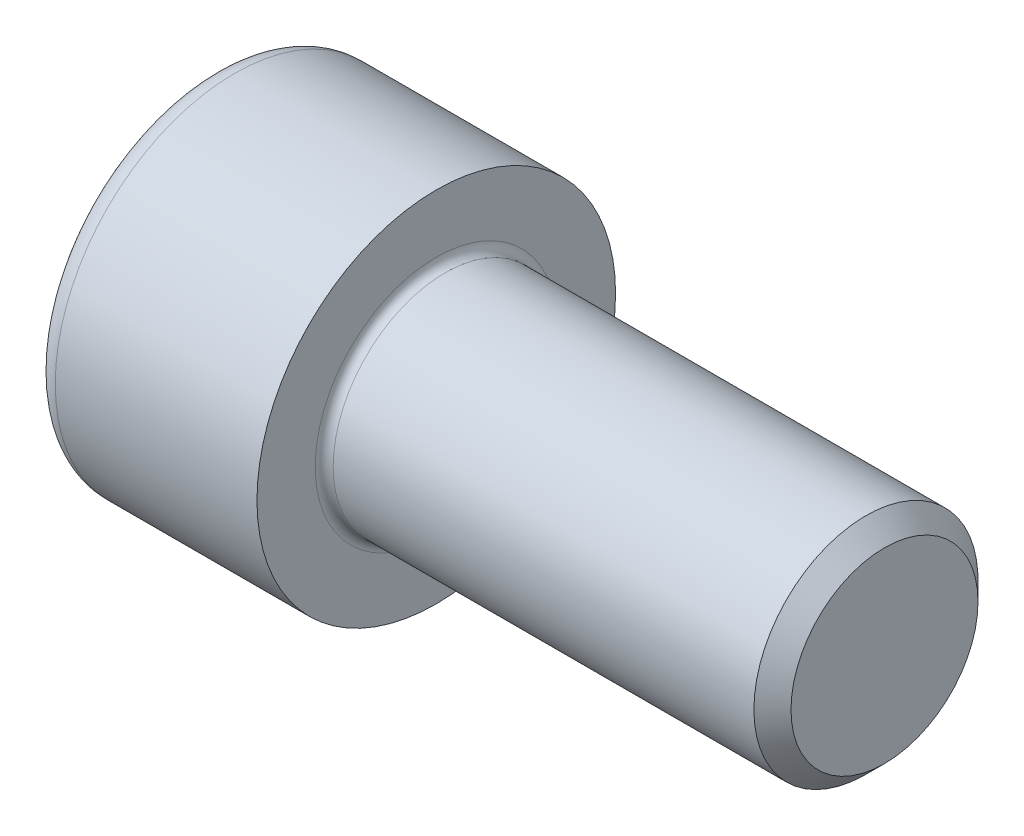
ISO-10303-21;
HEADER;
FILE_DESCRIPTION(('STEP AP214'),'2;1');
FILE_NAME('part.step','',(''),(''),'','','');
FILE_SCHEMA(('AUTOMOTIVE_DESIGN { 1 0 10303 214 1 1 1 1 }'));
ENDSEC;
DATA;
#1=APPLICATION_CONTEXT('core data for automotive mechanical design processes');
#2=APPLICATION_PROTOCOL_DEFINITION('international standard','automotive_design',2000,#1);
#3=PRODUCT_CONTEXT('',#1,'mechanical');
#4=PRODUCT('Part','Part','',(#3));
#5=PRODUCT_RELATED_PRODUCT_CATEGORY('part','',(#4));
#6=PRODUCT_DEFINITION_FORMATION('','',#4);
#7=PRODUCT_DEFINITION_CONTEXT('part definition',#1,'design');
#8=PRODUCT_DEFINITION('design','',#6,#7);
#9=PRODUCT_DEFINITION_SHAPE('','',#8);
#10=(LENGTH_UNIT() NAMED_UNIT(*) SI_UNIT(.MILLI.,.METRE.));
#11=(NAMED_UNIT(*) PLANE_ANGLE_UNIT() SI_UNIT($,.RADIAN.));
#12=(NAMED_UNIT(*) SI_UNIT($,.STERADIAN.) SOLID_ANGLE_UNIT());
#13=UNCERTAINTY_MEASURE_WITH_UNIT(LENGTH_MEASURE(1.E-05),#10,'distance_accuracy_value','');
#14=(GEOMETRIC_REPRESENTATION_CONTEXT(3) GLOBAL_UNCERTAINTY_ASSIGNED_CONTEXT((#13)) GLOBAL_UNIT_ASSIGNED_CONTEXT((#10,
#11,#12)) REPRESENTATION_CONTEXT('',''));
#15=CARTESIAN_POINT('',(0.,0.,0.));
#16=DIRECTION('',(0.,0.,1.));
#17=DIRECTION('',(1.,0.,0.));
#18=AXIS2_PLACEMENT_3D('',#15,#16,#17);
#19=CARTESIAN_POINT('',(0.,0.,0.));
#20=DIRECTION('',(-1.,0.,0.));
#21=DIRECTION('',(0.,0.,1.));
#22=AXIS2_PLACEMENT_3D('',#19,#20,#21);
#23=PLANE('',#22);
#24=DIRECTION('',(0.,-0.499999999999999,0.866025403784439));
#25=VECTOR('',#24,1.);
#26=CARTESIAN_POINT('',(0.,4.63323591024674,0.));
#27=LINE('',#26,#25);
#28=CARTESIAN_POINT('',(0.,4.63323591024674,0.));
#29=VERTEX_POINT('',#28);
#30=CARTESIAN_POINT('',(0.,2.31661795512337,4.01249999999999));
#31=VERTEX_POINT('',#30);
#32=EDGE_CURVE('E258',#29,#31,#27,.T.);
#33=ORIENTED_EDGE('',*,*,#32,.T.);
#34=DIRECTION('',(0.,1.,0.));
#35=VECTOR('',#34,1.);
#36=CARTESIAN_POINT('',(0.,-2.31661795512337,4.0125));
#37=LINE('',#36,#35);
#38=CARTESIAN_POINT('',(0.,-2.31661795512337,4.0125));
#39=VERTEX_POINT('',#38);
#40=EDGE_CURVE('E130',#39,#31,#37,.T.);
#41=ORIENTED_EDGE('',*,*,#40,.F.);
#42=DIRECTION('',(0.,-0.500000000000001,-0.866025403784438));
#43=VECTOR('',#42,1.);
#44=CARTESIAN_POINT('',(0.,-2.31661795512337,4.0125));
#45=LINE('',#44,#43);
#46=CARTESIAN_POINT('',(0.,-4.63323591024675,0.));
#47=VERTEX_POINT('',#46);
#48=EDGE_CURVE('E261',#39,#47,#45,.T.);
#49=ORIENTED_EDGE('',*,*,#48,.T.);
#50=DIRECTION('',(0.,0.499999999999999,-0.866025403784439));
#51=VECTOR('',#50,1.);
#52=CARTESIAN_POINT('',(0.,-4.63323591024675,0.));
#53=LINE('',#52,#51);
#54=CARTESIAN_POINT('',(0.,-2.31661795512338,-4.0125));
#55=VERTEX_POINT('',#54);
#56=EDGE_CURVE('E264',#47,#55,#53,.T.);
#57=ORIENTED_EDGE('',*,*,#56,.T.);
#58=DIRECTION('',(0.,-1.,0.));
#59=VECTOR('',#58,1.);
#60=CARTESIAN_POINT('',(0.,2.31661795512336,-4.0125));
#61=LINE('',#60,#59);
#62=CARTESIAN_POINT('',(0.,2.31661795512336,-4.0125));
#63=VERTEX_POINT('',#62);
#64=EDGE_CURVE('E267',#63,#55,#61,.T.);
#65=ORIENTED_EDGE('',*,*,#64,.F.);
#66=DIRECTION('',(0.,-0.500000000000001,-0.866025403784438));
#67=VECTOR('',#66,1.);
#68=CARTESIAN_POINT('',(0.,4.63323591024674,0.));
#69=LINE('',#68,#67);
#70=EDGE_CURVE('E125',#29,#63,#69,.T.);
#71=ORIENTED_EDGE('',*,*,#70,.F.);
#72=EDGE_LOOP('',(#33,#41,#49,#57,#65,#71));
#73=FACE_BOUND('',#72,.T.);
#74=CARTESIAN_POINT('',(0.,0.,0.));
#75=DIRECTION('',(-1.,0.,0.));
#76=DIRECTION('',(0.,0.,1.));
#77=AXIS2_PLACEMENT_3D('',#74,#75,#76);
#78=CIRCLE('',#77,7.);
#79=CARTESIAN_POINT('',(0.,0.,7.));
#80=VERTEX_POINT('',#79);
#81=EDGE_CURVE('E42',#80,#80,#78,.T.);
#82=ORIENTED_EDGE('',*,*,#81,.T.);
#83=EDGE_LOOP('',(#82));
#84=FACE_BOUND('',#83,.T.);
#85=ADVANCED_FACE('F34',(#73,#84),#23,.T.);
#86=CARTESIAN_POINT('',(-31.75,0.,0.));
#87=DIRECTION('',(-1.,0.,0.));
#88=DIRECTION('',(0.,0.,1.));
#89=AXIS2_PLACEMENT_3D('',#86,#87,#88);
#90=CYLINDRICAL_SURFACE('',#89,8.);
#91=CARTESIAN_POINT('',(1.,0.,0.));
#92=DIRECTION('',(-1.,0.,0.));
#93=DIRECTION('',(0.,0.,1.));
#94=AXIS2_PLACEMENT_3D('',#91,#92,#93);
#95=CIRCLE('',#94,8.);
#96=CARTESIAN_POINT('',(1.,0.,8.));
#97=VERTEX_POINT('',#96);
#98=EDGE_CURVE('E11',#97,#97,#95,.F.);
#99=ORIENTED_EDGE('',*,*,#98,.T.);
#100=EDGE_LOOP('',(#99));
#101=FACE_BOUND('',#100,.T.);
#102=CARTESIAN_POINT('',(10.,0.,0.));
#103=DIRECTION('',(-1.,0.,0.));
#104=DIRECTION('',(0.,0.,1.));
#105=AXIS2_PLACEMENT_3D('',#102,#103,#104);
#106=CIRCLE('',#105,8.);
#107=CARTESIAN_POINT('',(10.,0.,8.));
#108=VERTEX_POINT('',#107);
#109=EDGE_CURVE('E148',#108,#108,#106,.T.);
#110=ORIENTED_EDGE('',*,*,#109,.T.);
#111=EDGE_LOOP('',(#110));
#112=FACE_BOUND('',#111,.T.);
#113=ADVANCED_FACE('F172',(#101,#112),#90,.T.);
#114=CARTESIAN_POINT('',(10.,8.,0.));
#115=DIRECTION('',(1.,0.,0.));
#116=DIRECTION('',(0.,0.,-1.));
#117=AXIS2_PLACEMENT_3D('',#114,#115,#116);
#118=PLANE('',#117);
#119=CARTESIAN_POINT('',(10.,0.,0.));
#120=DIRECTION('',(1.,0.,0.));
#121=DIRECTION('',(0.,0.,-1.));
#122=AXIS2_PLACEMENT_3D('',#119,#120,#121);
#123=CIRCLE('',#122,5.39999999999999);
#124=CARTESIAN_POINT('',(10.,0.,-5.39999999999999));
#125=VERTEX_POINT('',#124);
#126=EDGE_CURVE('E151',#125,#125,#123,.F.);
#127=ORIENTED_EDGE('',*,*,#126,.T.);
#128=EDGE_LOOP('',(#127));
#129=FACE_BOUND('',#128,.T.);
#130=ORIENTED_EDGE('',*,*,#109,.F.);
#131=EDGE_LOOP('',(#130));
#132=FACE_BOUND('',#131,.T.);
#133=ADVANCED_FACE('F178',(#129,#132),#118,.T.);
#134=CARTESIAN_POINT('',(-31.75,0.,0.));
#135=DIRECTION('',(-1.,0.,0.));
#136=DIRECTION('',(0.,0.,1.));
#137=AXIS2_PLACEMENT_3D('',#134,#135,#136);
#138=CYLINDRICAL_SURFACE('',#137,4.99999999999999);
#139=CARTESIAN_POINT('',(10.4,0.,0.));
#140=DIRECTION('',(1.,0.,0.));
#141=DIRECTION('',(0.,0.,-1.));
#142=AXIS2_PLACEMENT_3D('',#139,#140,#141);
#143=CIRCLE('',#142,4.99999999999999);
#144=CARTESIAN_POINT('',(10.4,0.,-4.99999999999999));
#145=VERTEX_POINT('',#144);
#146=EDGE_CURVE('E154',#145,#145,#143,.T.);
#147=ORIENTED_EDGE('',*,*,#146,.T.);
#148=EDGE_LOOP('',(#147));
#149=FACE_BOUND('',#148,.T.);
#150=CARTESIAN_POINT('',(29.172,0.,0.));
#151=DIRECTION('',(-1.,0.,0.));
#152=DIRECTION('',(0.,0.,1.));
#153=AXIS2_PLACEMENT_3D('',#150,#151,#152);
#154=CIRCLE('',#153,4.99999999999998);
#155=CARTESIAN_POINT('',(29.172,0.,4.99999999999998));
#156=VERTEX_POINT('',#155);
#157=EDGE_CURVE('E145',#156,#156,#154,.T.);
#158=ORIENTED_EDGE('',*,*,#157,.T.);
#159=EDGE_LOOP('',(#158));
#160=FACE_BOUND('',#159,.T.);
#161=ADVANCED_FACE('F184',(#149,#160),#138,.T.);
#162=CARTESIAN_POINT('',(30.,0.,0.));
#163=DIRECTION('',(-1.,0.,0.));
#164=DIRECTION('',(0.,0.,1.));
#165=AXIS2_PLACEMENT_3D('',#162,#163,#164);
#166=CONICAL_SURFACE('',#165,4.172,0.78539816339742);
#167=ORIENTED_EDGE('',*,*,#157,.F.);
#168=EDGE_LOOP('',(#167));
#169=FACE_BOUND('',#168,.T.);
#170=CARTESIAN_POINT('',(30.,0.,0.));
#171=DIRECTION('',(-1.,0.,0.));
#172=DIRECTION('',(0.,0.,1.));
#173=AXIS2_PLACEMENT_3D('',#170,#171,#172);
#174=CIRCLE('',#173,4.172);
#175=CARTESIAN_POINT('',(30.,0.,4.172));
#176=VERTEX_POINT('',#175);
#177=EDGE_CURVE('E141',#176,#176,#174,.T.);
#178=ORIENTED_EDGE('',*,*,#177,.T.);
#179=EDGE_LOOP('',(#178));
#180=FACE_BOUND('',#179,.T.);
#181=ADVANCED_FACE('F188',(#169,#180),#166,.T.);
#182=CARTESIAN_POINT('',(30.,4.172,0.));
#183=DIRECTION('',(1.,0.,0.));
#184=DIRECTION('',(0.,0.,-1.));
#185=AXIS2_PLACEMENT_3D('',#182,#183,#184);
#186=PLANE('',#185);
#187=ORIENTED_EDGE('',*,*,#177,.F.);
#188=EDGE_LOOP('',(#187));
#189=FACE_BOUND('',#188,.T.);
#190=ADVANCED_FACE('F168',(#189),#186,.T.);
#191=CARTESIAN_POINT('',(10.4,0.,0.));
#192=DIRECTION('',(1.,0.,0.));
#193=DIRECTION('',(0.,0.,-1.));
#194=AXIS2_PLACEMENT_3D('',#191,#192,#193);
#195=TOROIDAL_SURFACE('',#194,5.39999999999999,0.4);
#196=ORIENTED_EDGE('',*,*,#146,.F.);
#197=EDGE_LOOP('',(#196));
#198=FACE_BOUND('',#197,.T.);
#199=ORIENTED_EDGE('',*,*,#126,.F.);
#200=EDGE_LOOP('',(#199));
#201=FACE_BOUND('',#200,.T.);
#202=ADVANCED_FACE('F161',(#198,#201),#195,.F.);
#203=CARTESIAN_POINT('',(1.,0.,0.));
#204=DIRECTION('',(-1.,0.,0.));
#205=DIRECTION('',(0.,0.,1.));
#206=AXIS2_PLACEMENT_3D('',#203,#204,#205);
#207=TOROIDAL_SURFACE('',#206,7.,1.);
#208=ORIENTED_EDGE('',*,*,#98,.F.);
#209=EDGE_LOOP('',(#208));
#210=FACE_BOUND('',#209,.T.);
#211=ORIENTED_EDGE('',*,*,#81,.F.);
#212=EDGE_LOOP('',(#211));
#213=FACE_BOUND('',#212,.T.);
#214=ADVANCED_FACE('F36',(#210,#213),#207,.T.);
#215=CARTESIAN_POINT('',(5.,4.63323591024674,0.));
#216=DIRECTION('',(0.,-0.866025403784439,-0.499999999999999));
#217=DIRECTION('',(0.,0.499999999999999,-0.866025403784439));
#218=AXIS2_PLACEMENT_3D('',#215,#216,#217);
#219=PLANE('',#218);
#220=ORIENTED_EDGE('',*,*,#32,.F.);
#221=DIRECTION('',(-1.,0.,0.));
#222=VECTOR('',#221,1.);
#223=CARTESIAN_POINT('',(5.,4.63323591024674,0.));
#224=LINE('',#223,#222);
#225=CARTESIAN_POINT('',(5.,4.63323591024674,0.));
#226=VERTEX_POINT('',#225);
#227=EDGE_CURVE('E248',#226,#29,#224,.T.);
#228=ORIENTED_EDGE('',*,*,#227,.F.);
#229=DIRECTION('',(0.,-0.499999999999999,0.866025403784439));
#230=VECTOR('',#229,1.);
#231=CARTESIAN_POINT('',(5.,4.63323591024674,0.));
#232=LINE('',#231,#230);
#233=CARTESIAN_POINT('',(5.,3.47492693268506,2.00624999999999));
#234=VERTEX_POINT('',#233);
#235=EDGE_CURVE('E117',#226,#234,#232,.T.);
#236=ORIENTED_EDGE('',*,*,#235,.T.);
#237=CARTESIAN_POINT('',(5.,2.31661795512337,4.01249999999999));
#238=VERTEX_POINT('',#237);
#239=EDGE_CURVE('E108',#234,#238,#232,.T.);
#240=ORIENTED_EDGE('',*,*,#239,.T.);
#241=DIRECTION('',(-1.,0.,0.));
#242=VECTOR('',#241,1.);
#243=CARTESIAN_POINT('',(5.,2.31661795512337,4.01249999999999));
#244=LINE('',#243,#242);
#245=EDGE_CURVE('E122',#238,#31,#244,.T.);
#246=ORIENTED_EDGE('',*,*,#245,.T.);
#247=EDGE_LOOP('',(#220,#228,#236,#240,#246));
#248=FACE_BOUND('',#247,.T.);
#249=ADVANCED_FACE('F121',(#248),#219,.T.);
#250=CARTESIAN_POINT('',(5.,-2.31661795512337,4.0125));
#251=DIRECTION('',(0.,0.,1.));
#252=DIRECTION('',(0.,-1.,0.));
#253=AXIS2_PLACEMENT_3D('',#250,#251,#252);
#254=PLANE('',#253);
#255=ORIENTED_EDGE('',*,*,#40,.T.);
#256=ORIENTED_EDGE('',*,*,#245,.F.);
#257=DIRECTION('',(0.,1.,0.));
#258=VECTOR('',#257,1.);
#259=CARTESIAN_POINT('',(5.,-2.31661795512337,4.0125));
#260=LINE('',#259,#258);
#261=CARTESIAN_POINT('',(5.,0.,4.0125));
#262=VERTEX_POINT('',#261);
#263=EDGE_CURVE('E105',#262,#238,#260,.T.);
#264=ORIENTED_EDGE('',*,*,#263,.F.);
#265=CARTESIAN_POINT('',(5.,-2.31661795512337,4.0125));
#266=VERTEX_POINT('',#265);
#267=EDGE_CURVE('E116',#266,#262,#260,.T.);
#268=ORIENTED_EDGE('',*,*,#267,.F.);
#269=DIRECTION('',(-1.,0.,0.));
#270=VECTOR('',#269,1.);
#271=CARTESIAN_POINT('',(5.,-2.31661795512337,4.0125));
#272=LINE('',#271,#270);
#273=EDGE_CURVE('E132',#266,#39,#272,.T.);
#274=ORIENTED_EDGE('',*,*,#273,.T.);
#275=EDGE_LOOP('',(#255,#256,#264,#268,#274));
#276=FACE_BOUND('',#275,.T.);
#277=ADVANCED_FACE('F127',(#276),#254,.F.);
#278=CARTESIAN_POINT('',(5.,-2.31661795512337,4.0125));
#279=DIRECTION('',(0.,0.866025403784438,-0.500000000000001));
#280=DIRECTION('',(0.,0.500000000000001,0.866025403784438));
#281=AXIS2_PLACEMENT_3D('',#278,#279,#280);
#282=PLANE('',#281);
#283=ORIENTED_EDGE('',*,*,#48,.F.);
#284=ORIENTED_EDGE('',*,*,#273,.F.);
#285=DIRECTION('',(0.,-0.500000000000001,-0.866025403784438));
#286=VECTOR('',#285,1.);
#287=CARTESIAN_POINT('',(5.,-2.31661795512337,4.0125));
#288=LINE('',#287,#286);
#289=CARTESIAN_POINT('',(5.,-3.47492693268506,2.00625));
#290=VERTEX_POINT('',#289);
#291=EDGE_CURVE('E287',#266,#290,#288,.T.);
#292=ORIENTED_EDGE('',*,*,#291,.T.);
#293=CARTESIAN_POINT('',(5.,-4.63323591024675,0.));
#294=VERTEX_POINT('',#293);
#295=EDGE_CURVE('E276',#290,#294,#288,.T.);
#296=ORIENTED_EDGE('',*,*,#295,.T.);
#297=DIRECTION('',(-1.,0.,0.));
#298=VECTOR('',#297,1.);
#299=CARTESIAN_POINT('',(5.,-4.63323591024675,0.));
#300=LINE('',#299,#298);
#301=EDGE_CURVE('E137',#294,#47,#300,.T.);
#302=ORIENTED_EDGE('',*,*,#301,.T.);
#303=EDGE_LOOP('',(#283,#284,#292,#296,#302));
#304=FACE_BOUND('',#303,.T.);
#305=ADVANCED_FACE('F202',(#304),#282,.T.);
#306=CARTESIAN_POINT('',(5.,-4.63323591024675,0.));
#307=DIRECTION('',(0.,0.866025403784439,0.499999999999999));
#308=DIRECTION('',(0.,-0.499999999999999,0.866025403784439));
#309=AXIS2_PLACEMENT_3D('',#306,#307,#308);
#310=PLANE('',#309);
#311=ORIENTED_EDGE('',*,*,#56,.F.);
#312=ORIENTED_EDGE('',*,*,#301,.F.);
#313=DIRECTION('',(0.,0.499999999999999,-0.866025403784439));
#314=VECTOR('',#313,1.);
#315=CARTESIAN_POINT('',(5.,-4.63323591024675,0.));
#316=LINE('',#315,#314);
#317=CARTESIAN_POINT('',(5.,-3.47492693268507,-2.00625));
#318=VERTEX_POINT('',#317);
#319=EDGE_CURVE('E254',#294,#318,#316,.T.);
#320=ORIENTED_EDGE('',*,*,#319,.T.);
#321=CARTESIAN_POINT('',(5.,-2.31661795512338,-4.0125));
#322=VERTEX_POINT('',#321);
#323=EDGE_CURVE('E286',#318,#322,#316,.T.);
#324=ORIENTED_EDGE('',*,*,#323,.T.);
#325=DIRECTION('',(-1.,0.,0.));
#326=VECTOR('',#325,1.);
#327=CARTESIAN_POINT('',(5.,-2.31661795512338,-4.0125));
#328=LINE('',#327,#326);
#329=EDGE_CURVE('E247',#322,#55,#328,.T.);
#330=ORIENTED_EDGE('',*,*,#329,.T.);
#331=EDGE_LOOP('',(#311,#312,#320,#324,#330));
#332=FACE_BOUND('',#331,.T.);
#333=ADVANCED_FACE('F205',(#332),#310,.T.);
#334=CARTESIAN_POINT('',(5.,2.31661795512336,-4.0125));
#335=DIRECTION('',(0.,0.,-1.));
#336=DIRECTION('',(0.,1.,0.));
#337=AXIS2_PLACEMENT_3D('',#334,#335,#336);
#338=PLANE('',#337);
#339=ORIENTED_EDGE('',*,*,#64,.T.);
#340=ORIENTED_EDGE('',*,*,#329,.F.);
#341=DIRECTION('',(0.,-1.,0.));
#342=VECTOR('',#341,1.);
#343=CARTESIAN_POINT('',(5.,2.31661795512336,-4.0125));
#344=LINE('',#343,#342);
#345=CARTESIAN_POINT('',(5.,0.,-4.0125));
#346=VERTEX_POINT('',#345);
#347=EDGE_CURVE('E251',#346,#322,#344,.T.);
#348=ORIENTED_EDGE('',*,*,#347,.F.);
#349=CARTESIAN_POINT('',(5.,2.31661795512336,-4.0125));
#350=VERTEX_POINT('',#349);
#351=EDGE_CURVE('E49',#350,#346,#344,.T.);
#352=ORIENTED_EDGE('',*,*,#351,.F.);
#353=DIRECTION('',(-1.,0.,0.));
#354=VECTOR('',#353,1.);
#355=CARTESIAN_POINT('',(5.,2.31661795512336,-4.0125));
#356=LINE('',#355,#354);
#357=EDGE_CURVE('E244',#350,#63,#356,.T.);
#358=ORIENTED_EDGE('',*,*,#357,.T.);
#359=EDGE_LOOP('',(#339,#340,#348,#352,#358));
#360=FACE_BOUND('',#359,.T.);
#361=ADVANCED_FACE('F209',(#360),#338,.F.);
#362=CARTESIAN_POINT('',(5.,4.63323591024674,0.));
#363=DIRECTION('',(0.,0.866025403784438,-0.500000000000001));
#364=DIRECTION('',(0.,0.500000000000001,0.866025403784438));
#365=AXIS2_PLACEMENT_3D('',#362,#363,#364);
#366=PLANE('',#365);
#367=ORIENTED_EDGE('',*,*,#70,.T.);
#368=ORIENTED_EDGE('',*,*,#357,.F.);
#369=DIRECTION('',(0.,-0.500000000000001,-0.866025403784438));
#370=VECTOR('',#369,1.);
#371=CARTESIAN_POINT('',(5.,4.63323591024674,0.));
#372=LINE('',#371,#370);
#373=CARTESIAN_POINT('',(5.,3.47492693268505,-2.00625));
#374=VERTEX_POINT('',#373);
#375=EDGE_CURVE('E234',#374,#350,#372,.T.);
#376=ORIENTED_EDGE('',*,*,#375,.F.);
#377=EDGE_CURVE('E240',#226,#374,#372,.T.);
#378=ORIENTED_EDGE('',*,*,#377,.F.);
#379=ORIENTED_EDGE('',*,*,#227,.T.);
#380=EDGE_LOOP('',(#367,#368,#376,#378,#379));
#381=FACE_BOUND('',#380,.T.);
#382=ADVANCED_FACE('F213',(#381),#366,.F.);
#383=CARTESIAN_POINT('',(5.,4.63323591024674,0.));
#384=DIRECTION('',(1.,0.,0.));
#385=DIRECTION('',(0.,0.,-1.));
#386=AXIS2_PLACEMENT_3D('',#383,#384,#385);
#387=PLANE('',#386);
#388=ORIENTED_EDGE('',*,*,#347,.T.);
#389=ORIENTED_EDGE('',*,*,#323,.F.);
#390=CARTESIAN_POINT('',(5.,0.,0.));
#391=DIRECTION('',(-1.,0.,0.));
#392=DIRECTION('',(0.,0.,1.));
#393=AXIS2_PLACEMENT_3D('',#390,#391,#392);
#394=CIRCLE('',#393,4.0125);
#395=EDGE_CURVE('E282',#346,#318,#394,.T.);
#396=ORIENTED_EDGE('',*,*,#395,.F.);
#397=EDGE_LOOP('',(#388,#389,#396));
#398=FACE_BOUND('',#397,.T.);
#399=ADVANCED_FACE('F217',(#398),#387,.F.);
#400=ORIENTED_EDGE('',*,*,#319,.F.);
#401=ORIENTED_EDGE('',*,*,#295,.F.);
#402=EDGE_CURVE('E135',#318,#290,#394,.T.);
#403=ORIENTED_EDGE('',*,*,#402,.F.);
#404=EDGE_LOOP('',(#400,#401,#403));
#405=FACE_BOUND('',#404,.T.);
#406=ADVANCED_FACE('F220',(#405),#387,.F.);
#407=ORIENTED_EDGE('',*,*,#291,.F.);
#408=ORIENTED_EDGE('',*,*,#267,.T.);
#409=EDGE_CURVE('E131',#290,#262,#394,.T.);
#410=ORIENTED_EDGE('',*,*,#409,.F.);
#411=EDGE_LOOP('',(#407,#408,#410));
#412=FACE_BOUND('',#411,.T.);
#413=ADVANCED_FACE('F225',(#412),#387,.F.);
#414=ORIENTED_EDGE('',*,*,#263,.T.);
#415=ORIENTED_EDGE('',*,*,#239,.F.);
#416=EDGE_CURVE('E111',#262,#234,#394,.T.);
#417=ORIENTED_EDGE('',*,*,#416,.F.);
#418=EDGE_LOOP('',(#414,#415,#417));
#419=FACE_BOUND('',#418,.T.);
#420=ADVANCED_FACE('F107',(#419),#387,.F.);
#421=ORIENTED_EDGE('',*,*,#235,.F.);
#422=ORIENTED_EDGE('',*,*,#377,.T.);
#423=EDGE_CURVE('E142',#234,#374,#394,.T.);
#424=ORIENTED_EDGE('',*,*,#423,.F.);
#425=EDGE_LOOP('',(#421,#422,#424));
#426=FACE_BOUND('',#425,.T.);
#427=ADVANCED_FACE('F228',(#426),#387,.F.);
#428=ORIENTED_EDGE('',*,*,#375,.T.);
#429=ORIENTED_EDGE('',*,*,#351,.T.);
#430=EDGE_CURVE('E237',#374,#346,#394,.T.);
#431=ORIENTED_EDGE('',*,*,#430,.F.);
#432=EDGE_LOOP('',(#428,#429,#431));
#433=FACE_BOUND('',#432,.T.);
#434=ADVANCED_FACE('F198',(#433),#387,.F.);
#435=CARTESIAN_POINT('',(5.,0.,0.));
#436=DIRECTION('',(-1.,0.,0.));
#437=DIRECTION('',(0.,0.,1.));
#438=AXIS2_PLACEMENT_3D('',#435,#436,#437);
#439=CONICAL_SURFACE('',#438,4.0125,1.04719755119659);
#440=CARTESIAN_POINT('',(7.31661795512339,0.,0.));
#441=VERTEX_POINT('',#440);
#442=VERTEX_LOOP('',#441);
#443=FACE_BOUND('',#442,.T.);
#444=ORIENTED_EDGE('',*,*,#416,.T.);
#445=ORIENTED_EDGE('',*,*,#423,.T.);
#446=ORIENTED_EDGE('',*,*,#430,.T.);
#447=ORIENTED_EDGE('',*,*,#395,.T.);
#448=ORIENTED_EDGE('',*,*,#402,.T.);
#449=ORIENTED_EDGE('',*,*,#409,.T.);
#450=EDGE_LOOP('',(#444,#445,#446,#447,#448,#449));
#451=FACE_BOUND('',#450,.T.);
#452=ADVANCED_FACE('F196',(#443,#451),#439,.F.);
#453=CLOSED_SHELL('',(#85,#113,#133,#161,#181,#190,#202,#214,#249,#277,#305,#333,#361,#382,#399,
#406,#413,#420,#427,#434,#452));
#454=MANIFOLD_SOLID_BREP('B2',#453);
#455=ADVANCED_BREP_SHAPE_REPRESENTATION('',(#18,#454),#14);
#456=SHAPE_DEFINITION_REPRESENTATION(#9,#455);
ENDSEC;
END-ISO-10303-21;
